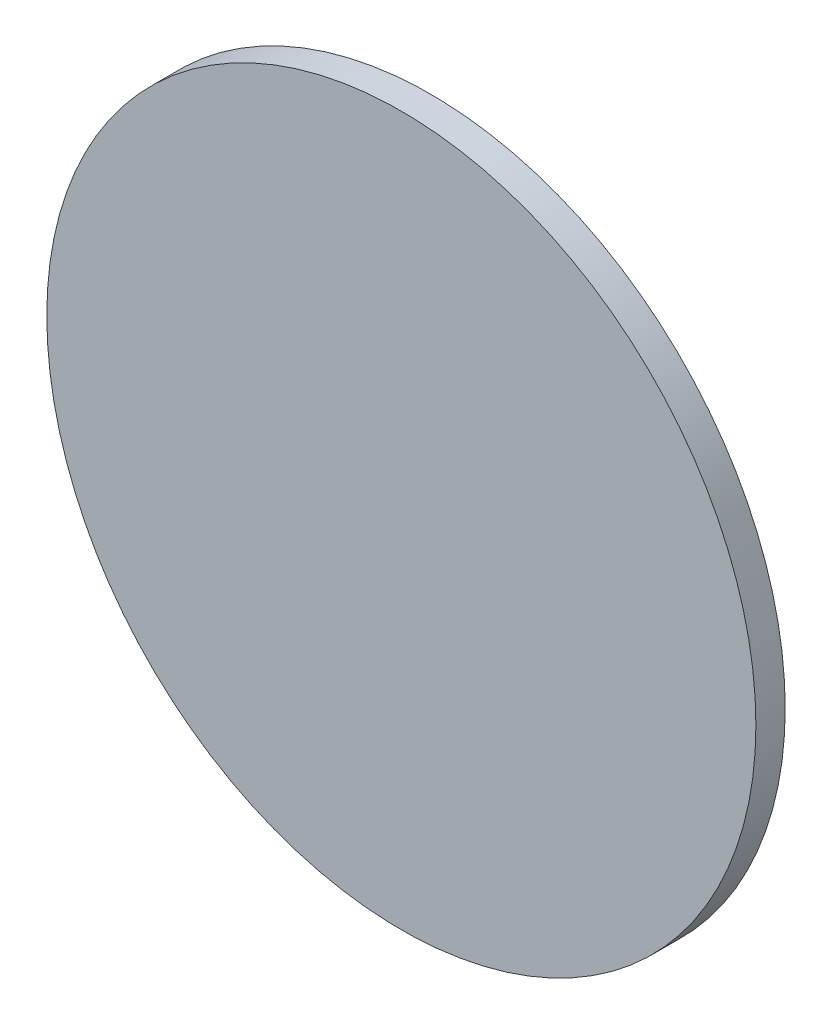
ISO-10303-21;
HEADER;
FILE_DESCRIPTION(('STEP AP214'),'2;1');
FILE_NAME('part.step','',(''),(''),'','','');
FILE_SCHEMA(('AUTOMOTIVE_DESIGN { 1 0 10303 214 1 1 1 1 }'));
ENDSEC;
DATA;
#1=APPLICATION_CONTEXT('core data for automotive mechanical design processes');
#2=APPLICATION_PROTOCOL_DEFINITION('international standard','automotive_design',2000,#1);
#3=PRODUCT_CONTEXT('',#1,'mechanical');
#4=PRODUCT('Part','Part','',(#3));
#5=PRODUCT_RELATED_PRODUCT_CATEGORY('part','',(#4));
#6=PRODUCT_DEFINITION_FORMATION('','',#4);
#7=PRODUCT_DEFINITION_CONTEXT('part definition',#1,'design');
#8=PRODUCT_DEFINITION('design','',#6,#7);
#9=PRODUCT_DEFINITION_SHAPE('','',#8);
#10=(LENGTH_UNIT() NAMED_UNIT(*) SI_UNIT(.MILLI.,.METRE.));
#11=(NAMED_UNIT(*) PLANE_ANGLE_UNIT() SI_UNIT($,.RADIAN.));
#12=(NAMED_UNIT(*) SI_UNIT($,.STERADIAN.) SOLID_ANGLE_UNIT());
#13=UNCERTAINTY_MEASURE_WITH_UNIT(LENGTH_MEASURE(1.E-05),#10,'distance_accuracy_value','');
#14=(GEOMETRIC_REPRESENTATION_CONTEXT(3) GLOBAL_UNCERTAINTY_ASSIGNED_CONTEXT((#13)) GLOBAL_UNIT_ASSIGNED_CONTEXT((#10,
#11,#12)) REPRESENTATION_CONTEXT('',''));
#15=CARTESIAN_POINT('',(0.,0.,0.));
#16=DIRECTION('',(0.,0.,1.));
#17=DIRECTION('',(1.,0.,0.));
#18=AXIS2_PLACEMENT_3D('',#15,#16,#17);
#19=CARTESIAN_POINT('',(0.,0.,0.3937));
#20=DIRECTION('',(0.,0.,-1.));
#21=DIRECTION('',(-1.,0.,0.));
#22=AXIS2_PLACEMENT_3D('',#19,#20,#21);
#23=CYLINDRICAL_SURFACE('',#22,9.525);
#24=CARTESIAN_POINT('',(0.,0.,0.3937));
#25=DIRECTION('',(0.,0.,1.));
#26=DIRECTION('',(1.,0.,0.));
#27=AXIS2_PLACEMENT_3D('',#24,#25,#26);
#28=CIRCLE('',#27,9.525);
#29=CARTESIAN_POINT('',(9.525,0.,0.3937));
#30=VERTEX_POINT('',#29);
#31=EDGE_CURVE('E10',#30,#30,#28,.T.);
#32=ORIENTED_EDGE('',*,*,#31,.F.);
#33=EDGE_LOOP('',(#32));
#34=FACE_BOUND('',#33,.T.);
#35=CARTESIAN_POINT('',(0.,0.,-0.3937));
#36=DIRECTION('',(0.,0.,1.));
#37=DIRECTION('',(1.,0.,0.));
#38=AXIS2_PLACEMENT_3D('',#35,#36,#37);
#39=CIRCLE('',#38,9.525);
#40=CARTESIAN_POINT('',(9.525,0.,-0.3937));
#41=VERTEX_POINT('',#40);
#42=EDGE_CURVE('E32',#41,#41,#39,.T.);
#43=ORIENTED_EDGE('',*,*,#42,.T.);
#44=EDGE_LOOP('',(#43));
#45=FACE_BOUND('',#44,.T.);
#46=ADVANCED_FACE('F29',(#34,#45),#23,.T.);
#47=CARTESIAN_POINT('',(0.,0.,0.3937));
#48=DIRECTION('',(0.,0.,1.));
#49=DIRECTION('',(1.,0.,0.));
#50=AXIS2_PLACEMENT_3D('',#47,#48,#49);
#51=PLANE('',#50);
#52=ORIENTED_EDGE('',*,*,#31,.T.);
#53=EDGE_LOOP('',(#52));
#54=FACE_BOUND('',#53,.T.);
#55=ADVANCED_FACE('F44',(#54),#51,.T.);
#56=CARTESIAN_POINT('',(0.,0.,-0.3937));
#57=DIRECTION('',(0.,0.,1.));
#58=DIRECTION('',(1.,0.,0.));
#59=AXIS2_PLACEMENT_3D('',#56,#57,#58);
#60=PLANE('',#59);
#61=ORIENTED_EDGE('',*,*,#42,.F.);
#62=EDGE_LOOP('',(#61));
#63=FACE_BOUND('',#62,.T.);
#64=ADVANCED_FACE('F42',(#63),#60,.F.);
#65=CLOSED_SHELL('',(#46,#55,#64));
#66=MANIFOLD_SOLID_BREP('B2',#65);
#67=ADVANCED_BREP_SHAPE_REPRESENTATION('',(#18,#66),#14);
#68=SHAPE_DEFINITION_REPRESENTATION(#9,#67);
ENDSEC;
END-ISO-10303-21;
